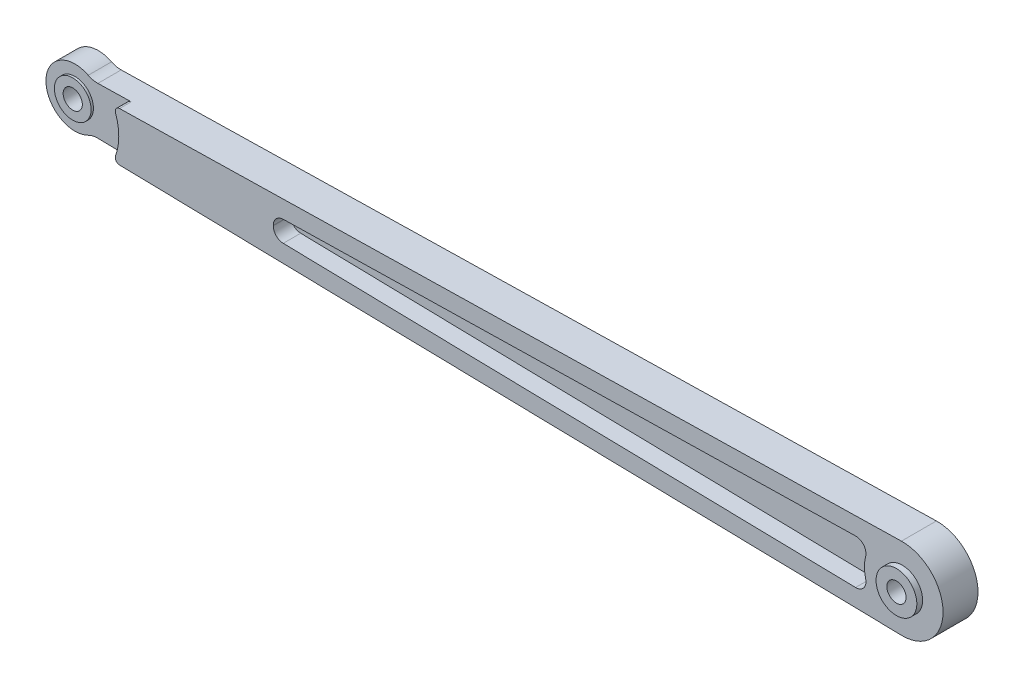
ISO-10303-21;
HEADER;
FILE_DESCRIPTION(('STEP AP214'),'2;1');
FILE_NAME('part.step','',(''),(''),'','','');
FILE_SCHEMA(('AUTOMOTIVE_DESIGN { 1 0 10303 214 1 1 1 1 }'));
ENDSEC;
DATA;
#1=APPLICATION_CONTEXT('core data for automotive mechanical design processes');
#2=APPLICATION_PROTOCOL_DEFINITION('international standard','automotive_design',2000,#1);
#3=PRODUCT_CONTEXT('',#1,'mechanical');
#4=PRODUCT('Part','Part','',(#3));
#5=PRODUCT_RELATED_PRODUCT_CATEGORY('part','',(#4));
#6=PRODUCT_DEFINITION_FORMATION('','',#4);
#7=PRODUCT_DEFINITION_CONTEXT('part definition',#1,'design');
#8=PRODUCT_DEFINITION('design','',#6,#7);
#9=PRODUCT_DEFINITION_SHAPE('','',#8);
#10=(LENGTH_UNIT() NAMED_UNIT(*) SI_UNIT(.MILLI.,.METRE.));
#11=(NAMED_UNIT(*) PLANE_ANGLE_UNIT() SI_UNIT($,.RADIAN.));
#12=(NAMED_UNIT(*) SI_UNIT($,.STERADIAN.) SOLID_ANGLE_UNIT());
#13=UNCERTAINTY_MEASURE_WITH_UNIT(LENGTH_MEASURE(1.E-05),#10,'distance_accuracy_value','');
#14=(GEOMETRIC_REPRESENTATION_CONTEXT(3) GLOBAL_UNCERTAINTY_ASSIGNED_CONTEXT((#13)) GLOBAL_UNIT_ASSIGNED_CONTEXT((#10,
#11,#12)) REPRESENTATION_CONTEXT('',''));
#15=CARTESIAN_POINT('',(0.,0.,0.));
#16=DIRECTION('',(0.,0.,1.));
#17=DIRECTION('',(1.,0.,0.));
#18=AXIS2_PLACEMENT_3D('',#15,#16,#17);
#19=CARTESIAN_POINT('',(0.,0.,6.));
#20=DIRECTION('',(0.,0.,1.));
#21=DIRECTION('',(1.,0.,0.));
#22=AXIS2_PLACEMENT_3D('',#19,#20,#21);
#23=PLANE('',#22);
#24=CARTESIAN_POINT('',(5.55111512312578E-13,-1.31893194282862E-12,6.));
#25=DIRECTION('',(0.,0.,1.));
#26=DIRECTION('',(1.,0.,0.));
#27=AXIS2_PLACEMENT_3D('',#24,#25,#26);
#28=CIRCLE('',#27,3.49999999999989);
#29=CARTESIAN_POINT('',(3.50000000000044,-1.31893194282862E-12,6.));
#30=VERTEX_POINT('',#29);
#31=EDGE_CURVE('E263',#30,#30,#28,.T.);
#32=ORIENTED_EDGE('',*,*,#31,.F.);
#33=EDGE_LOOP('',(#32));
#34=FACE_BOUND('',#33,.T.);
#35=DIRECTION('',(-0.999782962558486,-0.0208333333333333,0.));
#36=VECTOR('',#35,1.);
#37=CARTESIAN_POINT('',(-0.145833333333333,6.9984807379094,6.));
#38=LINE('',#37,#36);
#39=CARTESIAN_POINT('',(-0.145833333333333,6.9984807379094,6.));
#40=VERTEX_POINT('',#39);
#41=CARTESIAN_POINT('',(-134.364332130792,4.20165499705919,6.));
#42=VERTEX_POINT('',#41);
#43=EDGE_CURVE('E270',#40,#42,#38,.T.);
#44=ORIENTED_EDGE('',*,*,#43,.T.);
#45=CARTESIAN_POINT('',(-134.348707130792,3.45181777514032,6.));
#46=DIRECTION('',(0.,0.,1.));
#47=DIRECTION('',(1.,0.,0.));
#48=AXIS2_PLACEMENT_3D('',#45,#46,#47);
#49=CIRCLE('',#48,0.75);
#50=CARTESIAN_POINT('',(-135.054899291954,3.19924574281297,6.));
#51=VERTEX_POINT('',#50);
#52=EDGE_CURVE('E305',#42,#51,#49,.T.);
#53=ORIENTED_EDGE('',*,*,#52,.T.);
#54=CARTESIAN_POINT('',(-144.,0.,6.));
#55=DIRECTION('',(0.,0.,1.));
#56=DIRECTION('',(1.,0.,0.));
#57=AXIS2_PLACEMENT_3D('',#54,#55,#56);
#58=CIRCLE('',#57,9.50000000000001);
#59=CARTESIAN_POINT('',(-135.054899291954,-3.19924574281298,6.));
#60=VERTEX_POINT('',#59);
#61=EDGE_CURVE('E297',#60,#51,#58,.T.);
#62=ORIENTED_EDGE('',*,*,#61,.F.);
#63=CARTESIAN_POINT('',(-134.348707130792,-3.45181777514032,6.));
#64=DIRECTION('',(0.,0.,1.));
#65=DIRECTION('',(1.,0.,0.));
#66=AXIS2_PLACEMENT_3D('',#63,#64,#65);
#67=CIRCLE('',#66,0.75);
#68=CARTESIAN_POINT('',(-134.364332130792,-4.20165499705919,6.));
#69=VERTEX_POINT('',#68);
#70=EDGE_CURVE('E303',#60,#69,#67,.T.);
#71=ORIENTED_EDGE('',*,*,#70,.T.);
#72=DIRECTION('',(-0.999782962558486,0.0208333333333333,0.));
#73=VECTOR('',#72,1.);
#74=CARTESIAN_POINT('',(-0.145833333333333,-6.9984807379094,6.));
#75=LINE('',#74,#73);
#76=CARTESIAN_POINT('',(-0.145833333333333,-6.9984807379094,6.));
#77=VERTEX_POINT('',#76);
#78=EDGE_CURVE('E273',#77,#69,#75,.T.);
#79=ORIENTED_EDGE('',*,*,#78,.F.);
#80=CARTESIAN_POINT('',(0.,0.,6.));
#81=DIRECTION('',(0.,0.,1.));
#82=DIRECTION('',(1.,0.,0.));
#83=AXIS2_PLACEMENT_3D('',#80,#81,#82);
#84=CIRCLE('',#83,7.);
#85=EDGE_CURVE('E277',#77,#40,#84,.T.);
#86=ORIENTED_EDGE('',*,*,#85,.T.);
#87=EDGE_LOOP('',(#44,#53,#62,#71,#79,#86));
#88=FACE_BOUND('',#87,.T.);
#89=CARTESIAN_POINT('',(-106.225718101395,0.036972230579262,6.));
#90=DIRECTION('',(0.,0.,1.));
#91=DIRECTION('',(1.,0.,0.));
#92=AXIS2_PLACEMENT_3D('',#89,#90,#91);
#93=CIRCLE('',#92,1.75000000000001);
#94=CARTESIAN_POINT('',(-106.262176434729,1.78659241505661,6.));
#95=VERTEX_POINT('',#94);
#96=CARTESIAN_POINT('',(-107.975717263159,0.0352593886860282,6.));
#97=VERTEX_POINT('',#96);
#98=EDGE_CURVE('E57',#95,#97,#93,.T.);
#99=ORIENTED_EDGE('',*,*,#98,.F.);
#100=DIRECTION('',(-0.999782962558486,-0.0208333333333333,0.));
#101=VECTOR('',#100,1.);
#102=CARTESIAN_POINT('',(-8.01886458523978,3.83377239329242,6.));
#103=LINE('',#102,#101);
#104=CARTESIAN_POINT('',(-8.01886458523978,3.83377239329242,6.));
#105=VERTEX_POINT('',#104);
#106=EDGE_CURVE('E187',#105,#95,#103,.T.);
#107=ORIENTED_EDGE('',*,*,#106,.F.);
#108=CARTESIAN_POINT('',(-7.98240625190644,2.08415220881507,6.));
#109=DIRECTION('',(0.,0.,1.));
#110=DIRECTION('',(1.,0.,0.));
#111=AXIS2_PLACEMENT_3D('',#108,#109,#110);
#112=CIRCLE('',#111,1.75);
#113=CARTESIAN_POINT('',(-6.28916856210797,1.64205931603583,6.));
#114=VERTEX_POINT('',#113);
#115=EDGE_CURVE('E190',#114,#105,#112,.T.);
#116=ORIENTED_EDGE('',*,*,#115,.F.);
#117=CARTESIAN_POINT('',(5.55111512312578E-13,-1.31893194282862E-12,6.));
#118=DIRECTION('',(0.,0.,-1.));
#119=DIRECTION('',(-1.,0.,0.));
#120=AXIS2_PLACEMENT_3D('',#117,#118,#119);
#121=CIRCLE('',#120,6.49999999999989);
#122=CARTESIAN_POINT('',(-6.28916856210851,-1.64205931603638,6.));
#123=VERTEX_POINT('',#122);
#124=EDGE_CURVE('E218',#123,#114,#121,.T.);
#125=ORIENTED_EDGE('',*,*,#124,.F.);
#126=CARTESIAN_POINT('',(-7.98240625190714,-2.08415220881506,6.));
#127=DIRECTION('',(0.,0.,1.));
#128=DIRECTION('',(1.,0.,0.));
#129=AXIS2_PLACEMENT_3D('',#126,#127,#128);
#130=CIRCLE('',#129,1.75);
#131=CARTESIAN_POINT('',(-8.01886458524047,-3.83377239329241,6.));
#132=VERTEX_POINT('',#131);
#133=EDGE_CURVE('E215',#132,#123,#130,.T.);
#134=ORIENTED_EDGE('',*,*,#133,.F.);
#135=DIRECTION('',(0.999782962558485,-0.0208333333333333,0.));
#136=VECTOR('',#135,1.);
#137=CARTESIAN_POINT('',(-8.01886458524047,-3.83377239329241,6.));
#138=LINE('',#137,#136);
#139=CARTESIAN_POINT('',(-106.262176434729,-1.78659241505661,6.));
#140=VERTEX_POINT('',#139);
#141=EDGE_CURVE('E212',#140,#132,#138,.T.);
#142=ORIENTED_EDGE('',*,*,#141,.F.);
#143=CARTESIAN_POINT('',(-106.225718101395,-0.0369722305792641,6.));
#144=DIRECTION('',(0.,0.,1.));
#145=DIRECTION('',(1.,0.,0.));
#146=AXIS2_PLACEMENT_3D('',#143,#144,#145);
#147=CIRCLE('',#146,1.75000000000001);
#148=CARTESIAN_POINT('',(-107.975717263159,-0.0352593886860438,6.));
#149=VERTEX_POINT('',#148);
#150=EDGE_CURVE('E209',#149,#140,#147,.T.);
#151=ORIENTED_EDGE('',*,*,#150,.F.);
#152=CARTESIAN_POINT('',(-144.,0.,6.));
#153=DIRECTION('',(0.,0.,-1.));
#154=DIRECTION('',(1.,0.,0.));
#155=AXIS2_PLACEMENT_3D('',#152,#153,#154);
#156=CIRCLE('',#155,36.024299992205);
#157=EDGE_CURVE('E207',#97,#149,#156,.T.);
#158=ORIENTED_EDGE('',*,*,#157,.F.);
#159=EDGE_LOOP('',(#99,#107,#116,#125,#134,#142,#151,#158));
#160=FACE_BOUND('',#159,.T.);
#161=ADVANCED_FACE('F42',(#34,#88,#160),#23,.T.);
#162=CARTESIAN_POINT('',(-144.,0.,4.));
#163=DIRECTION('',(0.,0.,1.));
#164=DIRECTION('',(1.,0.,0.));
#165=AXIS2_PLACEMENT_3D('',#162,#163,#164);
#166=PLANE('',#165);
#167=DIRECTION('',(-0.999782962558486,-0.0208333333333333,0.));
#168=VECTOR('',#167,1.);
#169=CARTESIAN_POINT('',(-0.145833333333333,6.9984807379094,4.));
#170=LINE('',#169,#168);
#171=CARTESIAN_POINT('',(-134.364332130792,4.20165499705919,4.));
#172=VERTEX_POINT('',#171);
#173=CARTESIAN_POINT('',(-140.084201483099,4.08246518356727,4.));
#174=VERTEX_POINT('',#173);
#175=EDGE_CURVE('E254',#172,#174,#170,.T.);
#176=ORIENTED_EDGE('',*,*,#175,.T.);
#177=CARTESIAN_POINT('',(-140.157118149766,7.58170555252197,4.));
#178=DIRECTION('',(0.,0.,1.));
#179=DIRECTION('',(1.,0.,0.));
#180=AXIS2_PLACEMENT_3D('',#177,#178,#179);
#181=CIRCLE('',#180,3.5);
#182=CARTESIAN_POINT('',(-141.739481264568,4.45982679560115,4.));
#183=VERTEX_POINT('',#182);
#184=EDGE_CURVE('E332',#174,#183,#181,.F.);
#185=ORIENTED_EDGE('',*,*,#184,.T.);
#186=CARTESIAN_POINT('',(-144.,0.,4.));
#187=DIRECTION('',(0.,0.,1.));
#188=DIRECTION('',(1.,0.,0.));
#189=AXIS2_PLACEMENT_3D('',#186,#187,#188);
#190=CIRCLE('',#189,4.99999999999999);
#191=CARTESIAN_POINT('',(-141.739481264568,-4.45982679560115,4.));
#192=VERTEX_POINT('',#191);
#193=EDGE_CURVE('E251',#183,#192,#190,.T.);
#194=ORIENTED_EDGE('',*,*,#193,.T.);
#195=CARTESIAN_POINT('',(-140.157118149766,-7.58170555252197,4.));
#196=DIRECTION('',(0.,0.,1.));
#197=DIRECTION('',(1.,0.,0.));
#198=AXIS2_PLACEMENT_3D('',#195,#196,#197);
#199=CIRCLE('',#198,3.5);
#200=CARTESIAN_POINT('',(-140.084201483099,-4.08246518356727,4.));
#201=VERTEX_POINT('',#200);
#202=EDGE_CURVE('E12',#192,#201,#199,.F.);
#203=ORIENTED_EDGE('',*,*,#202,.T.);
#204=DIRECTION('',(-0.999782962558486,0.0208333333333333,0.));
#205=VECTOR('',#204,1.);
#206=CARTESIAN_POINT('',(-0.145833333333333,-6.9984807379094,4.));
#207=LINE('',#206,#205);
#208=CARTESIAN_POINT('',(-134.364332130792,-4.20165499705919,4.));
#209=VERTEX_POINT('',#208);
#210=EDGE_CURVE('E248',#209,#201,#207,.T.);
#211=ORIENTED_EDGE('',*,*,#210,.F.);
#212=CARTESIAN_POINT('',(-134.348707130792,-3.45181777514032,4.));
#213=DIRECTION('',(0.,0.,1.));
#214=DIRECTION('',(1.,0.,0.));
#215=AXIS2_PLACEMENT_3D('',#212,#213,#214);
#216=CIRCLE('',#215,0.75);
#217=CARTESIAN_POINT('',(-135.054899291954,-3.19924574281298,4.));
#218=VERTEX_POINT('',#217);
#219=EDGE_CURVE('E318',#209,#218,#216,.F.);
#220=ORIENTED_EDGE('',*,*,#219,.T.);
#221=CARTESIAN_POINT('',(-144.,0.,4.));
#222=DIRECTION('',(0.,0.,1.));
#223=DIRECTION('',(1.,0.,0.));
#224=AXIS2_PLACEMENT_3D('',#221,#222,#223);
#225=CIRCLE('',#224,9.50000000000001);
#226=CARTESIAN_POINT('',(-135.054899291954,3.19924574281297,4.));
#227=VERTEX_POINT('',#226);
#228=EDGE_CURVE('E243',#218,#227,#225,.T.);
#229=ORIENTED_EDGE('',*,*,#228,.T.);
#230=CARTESIAN_POINT('',(-134.348707130792,3.45181777514032,4.));
#231=DIRECTION('',(0.,0.,1.));
#232=DIRECTION('',(1.,0.,0.));
#233=AXIS2_PLACEMENT_3D('',#230,#231,#232);
#234=CIRCLE('',#233,0.75);
#235=EDGE_CURVE('E315',#227,#172,#234,.F.);
#236=ORIENTED_EDGE('',*,*,#235,.T.);
#237=EDGE_LOOP('',(#176,#185,#194,#203,#211,#220,#229,#236));
#238=FACE_BOUND('',#237,.T.);
#239=CARTESIAN_POINT('',(-144.,0.,4.));
#240=DIRECTION('',(0.,0.,1.));
#241=DIRECTION('',(1.,0.,0.));
#242=AXIS2_PLACEMENT_3D('',#239,#240,#241);
#243=CIRCLE('',#242,3.15000000000001);
#244=CARTESIAN_POINT('',(-140.85,0.,4.));
#245=VERTEX_POINT('',#244);
#246=EDGE_CURVE('E239',#245,#245,#243,.T.);
#247=ORIENTED_EDGE('',*,*,#246,.F.);
#248=EDGE_LOOP('',(#247));
#249=FACE_BOUND('',#248,.T.);
#250=ADVANCED_FACE('F346',(#238,#249),#166,.T.);
#251=CARTESIAN_POINT('',(-144.,0.,6.));
#252=DIRECTION('',(0.,0.,-1.));
#253=DIRECTION('',(-1.,0.,0.));
#254=AXIS2_PLACEMENT_3D('',#251,#252,#253);
#255=CYLINDRICAL_SURFACE('',#254,4.99999999999999);
#256=ORIENTED_EDGE('',*,*,#193,.F.);
#257=DIRECTION('',(0.,0.,-1.));
#258=VECTOR('',#257,1.);
#259=CARTESIAN_POINT('',(-141.739481264568,4.45982679560115,6.));
#260=LINE('',#259,#258);
#261=CARTESIAN_POINT('',(-141.739481264568,4.45982679560115,0.));
#262=VERTEX_POINT('',#261);
#263=EDGE_CURVE('E323',#183,#262,#260,.T.);
#264=ORIENTED_EDGE('',*,*,#263,.T.);
#265=CARTESIAN_POINT('',(-144.,0.,0.));
#266=DIRECTION('',(0.,0.,1.));
#267=DIRECTION('',(1.,0.,0.));
#268=AXIS2_PLACEMENT_3D('',#265,#266,#267);
#269=CIRCLE('',#268,4.99999999999999);
#270=CARTESIAN_POINT('',(-141.739481264568,-4.45982679560115,0.));
#271=VERTEX_POINT('',#270);
#272=EDGE_CURVE('E282',#262,#271,#269,.T.);
#273=ORIENTED_EDGE('',*,*,#272,.T.);
#274=DIRECTION('',(0.,0.,-1.));
#275=VECTOR('',#274,1.);
#276=CARTESIAN_POINT('',(-141.739481264568,-4.45982679560115,6.));
#277=LINE('',#276,#275);
#278=EDGE_CURVE('E321',#271,#192,#277,.F.);
#279=ORIENTED_EDGE('',*,*,#278,.T.);
#280=EDGE_LOOP('',(#256,#264,#273,#279));
#281=FACE_BOUND('',#280,.T.);
#282=ADVANCED_FACE('F342',(#281),#255,.T.);
#283=CARTESIAN_POINT('',(-144.,0.,6.));
#284=DIRECTION('',(0.,0.,-1.));
#285=DIRECTION('',(-1.,0.,0.));
#286=AXIS2_PLACEMENT_3D('',#283,#284,#285);
#287=CYLINDRICAL_SURFACE('',#286,1.65000000000002);
#288=CARTESIAN_POINT('',(-144.,0.,0.));
#289=DIRECTION('',(0.,0.,1.));
#290=DIRECTION('',(1.,0.,0.));
#291=AXIS2_PLACEMENT_3D('',#288,#289,#290);
#292=CIRCLE('',#291,1.65000000000002);
#293=CARTESIAN_POINT('',(-142.35,0.,0.));
#294=VERTEX_POINT('',#293);
#295=EDGE_CURVE('E274',#294,#294,#292,.T.);
#296=ORIENTED_EDGE('',*,*,#295,.F.);
#297=EDGE_LOOP('',(#296));
#298=FACE_BOUND('',#297,.T.);
#299=CARTESIAN_POINT('',(-144.,0.,4.4));
#300=DIRECTION('',(0.,0.,1.));
#301=DIRECTION('',(1.,0.,0.));
#302=AXIS2_PLACEMENT_3D('',#299,#300,#301);
#303=CIRCLE('',#302,1.65000000000002);
#304=CARTESIAN_POINT('',(-142.35,0.,4.4));
#305=VERTEX_POINT('',#304);
#306=EDGE_CURVE('E225',#305,#305,#303,.T.);
#307=ORIENTED_EDGE('',*,*,#306,.T.);
#308=EDGE_LOOP('',(#307));
#309=FACE_BOUND('',#308,.T.);
#310=ADVANCED_FACE('F450',(#298,#309),#287,.F.);
#311=CARTESIAN_POINT('',(-0.145833333333333,6.9984807379094,6.));
#312=DIRECTION('',(0.0208333333333333,-0.999782962558486,0.));
#313=DIRECTION('',(0.999782962558486,0.0208333333333333,0.));
#314=AXIS2_PLACEMENT_3D('',#311,#312,#313);
#315=PLANE('',#314);
#316=DIRECTION('',(-0.999782962558486,-0.0208333333333333,0.));
#317=VECTOR('',#316,1.);
#318=CARTESIAN_POINT('',(-0.145833333333333,6.9984807379094,0.));
#319=LINE('',#318,#317);
#320=CARTESIAN_POINT('',(-0.145833333333333,6.9984807379094,0.));
#321=VERTEX_POINT('',#320);
#322=CARTESIAN_POINT('',(-140.084201483099,4.08246518356727,0.));
#323=VERTEX_POINT('',#322);
#324=EDGE_CURVE('E267',#321,#323,#319,.T.);
#325=ORIENTED_EDGE('',*,*,#324,.T.);
#326=DIRECTION('',(0.,0.,1.));
#327=VECTOR('',#326,1.);
#328=CARTESIAN_POINT('',(-140.084201483099,4.08246518356727,4.));
#329=LINE('',#328,#327);
#330=EDGE_CURVE('E326',#323,#174,#329,.T.);
#331=ORIENTED_EDGE('',*,*,#330,.T.);
#332=ORIENTED_EDGE('',*,*,#175,.F.);
#333=DIRECTION('',(0.,0.,1.));
#334=VECTOR('',#333,1.);
#335=CARTESIAN_POINT('',(-134.364332130792,4.20165499705919,6.));
#336=LINE('',#335,#334);
#337=EDGE_CURVE('E300',#172,#42,#336,.T.);
#338=ORIENTED_EDGE('',*,*,#337,.T.);
#339=ORIENTED_EDGE('',*,*,#43,.F.);
#340=DIRECTION('',(0.,0.,-1.));
#341=VECTOR('',#340,1.);
#342=CARTESIAN_POINT('',(-0.145833333333333,6.9984807379094,6.));
#343=LINE('',#342,#341);
#344=EDGE_CURVE('E279',#40,#321,#343,.T.);
#345=ORIENTED_EDGE('',*,*,#344,.T.);
#346=EDGE_LOOP('',(#325,#331,#332,#338,#339,#345));
#347=FACE_BOUND('',#346,.T.);
#348=ADVANCED_FACE('F370',(#347),#315,.F.);
#349=CARTESIAN_POINT('',(-0.145833333333333,-6.9984807379094,6.));
#350=DIRECTION('',(-0.0208333333333333,-0.999782962558486,0.));
#351=DIRECTION('',(0.999782962558486,-0.0208333333333333,0.));
#352=AXIS2_PLACEMENT_3D('',#349,#350,#351);
#353=PLANE('',#352);
#354=ORIENTED_EDGE('',*,*,#210,.T.);
#355=DIRECTION('',(0.,0.,-1.));
#356=VECTOR('',#355,1.);
#357=CARTESIAN_POINT('',(-140.084201483099,-4.08246518356728,6.));
#358=LINE('',#357,#356);
#359=CARTESIAN_POINT('',(-140.084201483099,-4.08246518356728,0.));
#360=VERTEX_POINT('',#359);
#361=EDGE_CURVE('E328',#201,#360,#358,.T.);
#362=ORIENTED_EDGE('',*,*,#361,.T.);
#363=DIRECTION('',(-0.999782962558486,0.0208333333333333,0.));
#364=VECTOR('',#363,1.);
#365=CARTESIAN_POINT('',(-0.145833333333333,-6.9984807379094,0.));
#366=LINE('',#365,#364);
#367=CARTESIAN_POINT('',(-0.145833333333333,-6.9984807379094,0.));
#368=VERTEX_POINT('',#367);
#369=EDGE_CURVE('E284',#368,#360,#366,.T.);
#370=ORIENTED_EDGE('',*,*,#369,.F.);
#371=DIRECTION('',(0.,0.,-1.));
#372=VECTOR('',#371,1.);
#373=CARTESIAN_POINT('',(-0.145833333333333,-6.9984807379094,6.));
#374=LINE('',#373,#372);
#375=EDGE_CURVE('E295',#77,#368,#374,.T.);
#376=ORIENTED_EDGE('',*,*,#375,.F.);
#377=ORIENTED_EDGE('',*,*,#78,.T.);
#378=DIRECTION('',(0.,0.,-1.));
#379=VECTOR('',#378,1.);
#380=CARTESIAN_POINT('',(-134.364332130792,-4.20165499705919,4.));
#381=LINE('',#380,#379);
#382=EDGE_CURVE('E312',#69,#209,#381,.T.);
#383=ORIENTED_EDGE('',*,*,#382,.T.);
#384=EDGE_LOOP('',(#354,#362,#370,#376,#377,#383));
#385=FACE_BOUND('',#384,.T.);
#386=ADVANCED_FACE('F349',(#385),#353,.T.);
#387=CARTESIAN_POINT('',(0.,0.,6.));
#388=DIRECTION('',(0.,0.,-1.));
#389=DIRECTION('',(-1.,0.,0.));
#390=AXIS2_PLACEMENT_3D('',#387,#388,#389);
#391=CYLINDRICAL_SURFACE('',#390,7.);
#392=CARTESIAN_POINT('',(0.,0.,0.));
#393=DIRECTION('',(0.,0.,1.));
#394=DIRECTION('',(1.,0.,0.));
#395=AXIS2_PLACEMENT_3D('',#392,#393,#394);
#396=CIRCLE('',#395,7.);
#397=EDGE_CURVE('E289',#368,#321,#396,.T.);
#398=ORIENTED_EDGE('',*,*,#397,.T.);
#399=ORIENTED_EDGE('',*,*,#344,.F.);
#400=ORIENTED_EDGE('',*,*,#85,.F.);
#401=ORIENTED_EDGE('',*,*,#375,.T.);
#402=EDGE_LOOP('',(#398,#399,#400,#401));
#403=FACE_BOUND('',#402,.T.);
#404=ADVANCED_FACE('F375',(#403),#391,.T.);
#405=CARTESIAN_POINT('',(0.,0.,0.));
#406=DIRECTION('',(0.,0.,1.));
#407=DIRECTION('',(1.,0.,0.));
#408=AXIS2_PLACEMENT_3D('',#405,#406,#407);
#409=PLANE('',#408);
#410=CARTESIAN_POINT('',(5.55111512312578E-13,-1.31893194282862E-12,0.));
#411=DIRECTION('',(0.,0.,1.));
#412=DIRECTION('',(1.,0.,0.));
#413=AXIS2_PLACEMENT_3D('',#410,#411,#412);
#414=CIRCLE('',#413,1.64999999999989);
#415=CARTESIAN_POINT('',(1.65000000000044,-1.31893194282862E-12,0.));
#416=VERTEX_POINT('',#415);
#417=EDGE_CURVE('E260',#416,#416,#414,.T.);
#418=ORIENTED_EDGE('',*,*,#417,.T.);
#419=EDGE_LOOP('',(#418));
#420=FACE_BOUND('',#419,.T.);
#421=ORIENTED_EDGE('',*,*,#324,.F.);
#422=ORIENTED_EDGE('',*,*,#397,.F.);
#423=ORIENTED_EDGE('',*,*,#369,.T.);
#424=CARTESIAN_POINT('',(-140.157118149766,-7.58170555252197,0.));
#425=DIRECTION('',(0.,0.,1.));
#426=DIRECTION('',(1.,0.,0.));
#427=AXIS2_PLACEMENT_3D('',#424,#425,#426);
#428=CIRCLE('',#427,3.5);
#429=EDGE_CURVE('E50',#360,#271,#428,.T.);
#430=ORIENTED_EDGE('',*,*,#429,.T.);
#431=ORIENTED_EDGE('',*,*,#272,.F.);
#432=CARTESIAN_POINT('',(-140.157118149766,7.58170555252197,0.));
#433=DIRECTION('',(0.,0.,1.));
#434=DIRECTION('',(1.,0.,0.));
#435=AXIS2_PLACEMENT_3D('',#432,#433,#434);
#436=CIRCLE('',#435,3.5);
#437=EDGE_CURVE('E330',#262,#323,#436,.T.);
#438=ORIENTED_EDGE('',*,*,#437,.T.);
#439=EDGE_LOOP('',(#421,#422,#423,#430,#431,#438));
#440=FACE_BOUND('',#439,.T.);
#441=ORIENTED_EDGE('',*,*,#295,.T.);
#442=EDGE_LOOP('',(#441));
#443=FACE_BOUND('',#442,.T.);
#444=ADVANCED_FACE('F336',(#420,#440,#443),#409,.F.);
#445=CARTESIAN_POINT('',(5.55111512312578E-13,-1.31893194282862E-12,7.));
#446=DIRECTION('',(0.,0.,-1.));
#447=DIRECTION('',(-1.,0.,0.));
#448=AXIS2_PLACEMENT_3D('',#445,#446,#447);
#449=CYLINDRICAL_SURFACE('',#448,3.49999999999989);
#450=CARTESIAN_POINT('',(5.55111512312578E-13,-1.31893194282862E-12,7.));
#451=DIRECTION('',(0.,0.,1.));
#452=DIRECTION('',(1.,0.,0.));
#453=AXIS2_PLACEMENT_3D('',#450,#451,#452);
#454=CIRCLE('',#453,3.49999999999989);
#455=CARTESIAN_POINT('',(3.50000000000044,-1.31893194282862E-12,7.));
#456=VERTEX_POINT('',#455);
#457=EDGE_CURVE('E264',#456,#456,#454,.T.);
#458=ORIENTED_EDGE('',*,*,#457,.F.);
#459=EDGE_LOOP('',(#458));
#460=FACE_BOUND('',#459,.T.);
#461=ORIENTED_EDGE('',*,*,#31,.T.);
#462=EDGE_LOOP('',(#461));
#463=FACE_BOUND('',#462,.T.);
#464=ADVANCED_FACE('F442',(#460,#463),#449,.T.);
#465=CARTESIAN_POINT('',(5.55111512312578E-13,-1.31893194282862E-12,7.));
#466=DIRECTION('',(0.,0.,1.));
#467=DIRECTION('',(1.,0.,0.));
#468=AXIS2_PLACEMENT_3D('',#465,#466,#467);
#469=PLANE('',#468);
#470=CARTESIAN_POINT('',(5.55111512312578E-13,-1.31893194282862E-12,7.));
#471=DIRECTION('',(0.,0.,1.));
#472=DIRECTION('',(1.,0.,0.));
#473=AXIS2_PLACEMENT_3D('',#470,#471,#472);
#474=CIRCLE('',#473,1.64999999999989);
#475=CARTESIAN_POINT('',(1.65000000000044,-1.31893194282862E-12,7.));
#476=VERTEX_POINT('',#475);
#477=EDGE_CURVE('E257',#476,#476,#474,.T.);
#478=ORIENTED_EDGE('',*,*,#477,.F.);
#479=EDGE_LOOP('',(#478));
#480=FACE_BOUND('',#479,.T.);
#481=ORIENTED_EDGE('',*,*,#457,.T.);
#482=EDGE_LOOP('',(#481));
#483=FACE_BOUND('',#482,.T.);
#484=ADVANCED_FACE('F438',(#480,#483),#469,.T.);
#485=CARTESIAN_POINT('',(5.55111512312578E-13,-1.31893194282862E-12,-5.));
#486=DIRECTION('',(0.,0.,1.));
#487=DIRECTION('',(1.,0.,0.));
#488=AXIS2_PLACEMENT_3D('',#485,#486,#487);
#489=CYLINDRICAL_SURFACE('',#488,1.64999999999989);
#490=ORIENTED_EDGE('',*,*,#477,.T.);
#491=EDGE_LOOP('',(#490));
#492=FACE_BOUND('',#491,.T.);
#493=ORIENTED_EDGE('',*,*,#417,.F.);
#494=EDGE_LOOP('',(#493));
#495=FACE_BOUND('',#494,.T.);
#496=ADVANCED_FACE('F435',(#492,#495),#489,.F.);
#497=CARTESIAN_POINT('',(-144.,0.,4.));
#498=DIRECTION('',(0.,0.,1.));
#499=DIRECTION('',(1.,0.,0.));
#500=AXIS2_PLACEMENT_3D('',#497,#498,#499);
#501=CYLINDRICAL_SURFACE('',#500,9.50000000000001);
#502=ORIENTED_EDGE('',*,*,#61,.T.);
#503=DIRECTION('',(0.,0.,1.));
#504=VECTOR('',#503,1.);
#505=CARTESIAN_POINT('',(-135.054899291954,3.19924574281298,4.));
#506=LINE('',#505,#504);
#507=EDGE_CURVE('E310',#51,#227,#506,.F.);
#508=ORIENTED_EDGE('',*,*,#507,.T.);
#509=ORIENTED_EDGE('',*,*,#228,.F.);
#510=DIRECTION('',(0.,0.,1.));
#511=VECTOR('',#510,1.);
#512=CARTESIAN_POINT('',(-135.054899291954,-3.19924574281298,4.));
#513=LINE('',#512,#511);
#514=EDGE_CURVE('E307',#218,#60,#513,.T.);
#515=ORIENTED_EDGE('',*,*,#514,.T.);
#516=EDGE_LOOP('',(#502,#508,#509,#515));
#517=FACE_BOUND('',#516,.T.);
#518=ADVANCED_FACE('F359',(#517),#501,.F.);
#519=CARTESIAN_POINT('',(-134.348707130792,3.45181777514032,4.));
#520=DIRECTION('',(0.,0.,1.));
#521=DIRECTION('',(1.,0.,0.));
#522=AXIS2_PLACEMENT_3D('',#519,#520,#521);
#523=CYLINDRICAL_SURFACE('',#522,0.75);
#524=ORIENTED_EDGE('',*,*,#235,.F.);
#525=ORIENTED_EDGE('',*,*,#507,.F.);
#526=ORIENTED_EDGE('',*,*,#52,.F.);
#527=ORIENTED_EDGE('',*,*,#337,.F.);
#528=EDGE_LOOP('',(#524,#525,#526,#527));
#529=FACE_BOUND('',#528,.T.);
#530=ADVANCED_FACE('F363',(#529),#523,.T.);
#531=CARTESIAN_POINT('',(-134.348707130792,-3.45181777514032,4.));
#532=DIRECTION('',(0.,0.,1.));
#533=DIRECTION('',(1.,0.,0.));
#534=AXIS2_PLACEMENT_3D('',#531,#532,#533);
#535=CYLINDRICAL_SURFACE('',#534,0.75);
#536=ORIENTED_EDGE('',*,*,#219,.F.);
#537=ORIENTED_EDGE('',*,*,#382,.F.);
#538=ORIENTED_EDGE('',*,*,#70,.F.);
#539=ORIENTED_EDGE('',*,*,#514,.F.);
#540=EDGE_LOOP('',(#536,#537,#538,#539));
#541=FACE_BOUND('',#540,.T.);
#542=ADVANCED_FACE('F355',(#541),#535,.T.);
#543=CARTESIAN_POINT('',(-140.157118149766,7.58170555252197,6.));
#544=DIRECTION('',(0.,0.,-1.));
#545=DIRECTION('',(-1.,0.,0.));
#546=AXIS2_PLACEMENT_3D('',#543,#544,#545);
#547=CYLINDRICAL_SURFACE('',#546,3.5);
#548=ORIENTED_EDGE('',*,*,#184,.F.);
#549=ORIENTED_EDGE('',*,*,#330,.F.);
#550=ORIENTED_EDGE('',*,*,#437,.F.);
#551=ORIENTED_EDGE('',*,*,#263,.F.);
#552=EDGE_LOOP('',(#548,#549,#550,#551));
#553=FACE_BOUND('',#552,.T.);
#554=ADVANCED_FACE('F369',(#553),#547,.F.);
#555=CARTESIAN_POINT('',(-140.157118149766,-7.58170555252197,6.));
#556=DIRECTION('',(0.,0.,-1.));
#557=DIRECTION('',(-1.,0.,0.));
#558=AXIS2_PLACEMENT_3D('',#555,#556,#557);
#559=CYLINDRICAL_SURFACE('',#558,3.5);
#560=ORIENTED_EDGE('',*,*,#202,.F.);
#561=ORIENTED_EDGE('',*,*,#278,.F.);
#562=ORIENTED_EDGE('',*,*,#429,.F.);
#563=ORIENTED_EDGE('',*,*,#361,.F.);
#564=EDGE_LOOP('',(#560,#561,#562,#563));
#565=FACE_BOUND('',#564,.T.);
#566=ADVANCED_FACE('F44',(#565),#559,.F.);
#567=CARTESIAN_POINT('',(-144.,0.,4.4));
#568=DIRECTION('',(0.,0.,1.));
#569=DIRECTION('',(1.,0.,0.));
#570=AXIS2_PLACEMENT_3D('',#567,#568,#569);
#571=PLANE('',#570);
#572=CARTESIAN_POINT('',(-144.,0.,4.4));
#573=DIRECTION('',(0.,0.,1.));
#574=DIRECTION('',(1.,0.,0.));
#575=AXIS2_PLACEMENT_3D('',#572,#573,#574);
#576=CIRCLE('',#575,3.15000000000001);
#577=CARTESIAN_POINT('',(-140.85,0.,4.4));
#578=VERTEX_POINT('',#577);
#579=EDGE_CURVE('E240',#578,#578,#576,.T.);
#580=ORIENTED_EDGE('',*,*,#579,.T.);
#581=EDGE_LOOP('',(#580));
#582=FACE_BOUND('',#581,.T.);
#583=ORIENTED_EDGE('',*,*,#306,.F.);
#584=EDGE_LOOP('',(#583));
#585=FACE_BOUND('',#584,.T.);
#586=ADVANCED_FACE('F424',(#582,#585),#571,.T.);
#587=CARTESIAN_POINT('',(-144.,0.,4.4));
#588=DIRECTION('',(0.,0.,-1.));
#589=DIRECTION('',(-1.,0.,0.));
#590=AXIS2_PLACEMENT_3D('',#587,#588,#589);
#591=CYLINDRICAL_SURFACE('',#590,3.15000000000001);
#592=ORIENTED_EDGE('',*,*,#579,.F.);
#593=EDGE_LOOP('',(#592));
#594=FACE_BOUND('',#593,.T.);
#595=ORIENTED_EDGE('',*,*,#246,.T.);
#596=EDGE_LOOP('',(#595));
#597=FACE_BOUND('',#596,.T.);
#598=ADVANCED_FACE('F423',(#594,#597),#591,.T.);
#599=CARTESIAN_POINT('',(-106.225718101395,0.036972230579262,3.));
#600=DIRECTION('',(0.,0.,1.));
#601=DIRECTION('',(1.,0.,0.));
#602=AXIS2_PLACEMENT_3D('',#599,#600,#601);
#603=CYLINDRICAL_SURFACE('',#602,1.75000000000001);
#604=ORIENTED_EDGE('',*,*,#98,.T.);
#605=DIRECTION('',(0.,0.,1.));
#606=VECTOR('',#605,1.);
#607=CARTESIAN_POINT('',(-107.975717263159,0.0352593886860282,3.));
#608=LINE('',#607,#606);
#609=CARTESIAN_POINT('',(-107.975717263159,0.0352593886860282,3.));
#610=VERTEX_POINT('',#609);
#611=EDGE_CURVE('E164',#610,#97,#608,.T.);
#612=ORIENTED_EDGE('',*,*,#611,.F.);
#613=CARTESIAN_POINT('',(-106.225718101395,0.036972230579262,3.));
#614=DIRECTION('',(0.,0.,1.));
#615=DIRECTION('',(1.,0.,0.));
#616=AXIS2_PLACEMENT_3D('',#613,#614,#615);
#617=CIRCLE('',#616,1.75000000000001);
#618=CARTESIAN_POINT('',(-106.262176434729,1.78659241505661,3.));
#619=VERTEX_POINT('',#618);
#620=EDGE_CURVE('E168',#619,#610,#617,.T.);
#621=ORIENTED_EDGE('',*,*,#620,.F.);
#622=DIRECTION('',(0.,0.,1.));
#623=VECTOR('',#622,1.);
#624=CARTESIAN_POINT('',(-106.262176434729,1.78659241505661,3.));
#625=LINE('',#624,#623);
#626=EDGE_CURVE('E223',#619,#95,#625,.T.);
#627=ORIENTED_EDGE('',*,*,#626,.T.);
#628=EDGE_LOOP('',(#604,#612,#621,#627));
#629=FACE_BOUND('',#628,.T.);
#630=ADVANCED_FACE('F166',(#629),#603,.F.);
#631=CARTESIAN_POINT('',(-8.01886458523978,3.83377239329242,3.));
#632=DIRECTION('',(-0.0208333333333333,0.999782962558486,0.));
#633=DIRECTION('',(-0.999782962558486,-0.0208333333333333,0.));
#634=AXIS2_PLACEMENT_3D('',#631,#632,#633);
#635=PLANE('',#634);
#636=ORIENTED_EDGE('',*,*,#106,.T.);
#637=ORIENTED_EDGE('',*,*,#626,.F.);
#638=DIRECTION('',(-0.999782962558486,-0.0208333333333333,0.));
#639=VECTOR('',#638,1.);
#640=CARTESIAN_POINT('',(-8.01886458523978,3.83377239329242,3.));
#641=LINE('',#640,#639);
#642=CARTESIAN_POINT('',(-8.01886458523978,3.83377239329242,3.));
#643=VERTEX_POINT('',#642);
#644=EDGE_CURVE('E174',#643,#619,#641,.T.);
#645=ORIENTED_EDGE('',*,*,#644,.F.);
#646=DIRECTION('',(0.,0.,1.));
#647=VECTOR('',#646,1.);
#648=CARTESIAN_POINT('',(-8.01886458523978,3.83377239329242,3.));
#649=LINE('',#648,#647);
#650=EDGE_CURVE('E226',#643,#105,#649,.T.);
#651=ORIENTED_EDGE('',*,*,#650,.T.);
#652=EDGE_LOOP('',(#636,#637,#645,#651));
#653=FACE_BOUND('',#652,.T.);
#654=ADVANCED_FACE('F401',(#653),#635,.F.);
#655=CARTESIAN_POINT('',(-7.98240625190644,2.08415220881507,3.));
#656=DIRECTION('',(0.,0.,1.));
#657=DIRECTION('',(1.,0.,0.));
#658=AXIS2_PLACEMENT_3D('',#655,#656,#657);
#659=CYLINDRICAL_SURFACE('',#658,1.75);
#660=ORIENTED_EDGE('',*,*,#115,.T.);
#661=ORIENTED_EDGE('',*,*,#650,.F.);
#662=CARTESIAN_POINT('',(-7.98240625190644,2.08415220881507,3.));
#663=DIRECTION('',(0.,0.,1.));
#664=DIRECTION('',(1.,0.,0.));
#665=AXIS2_PLACEMENT_3D('',#662,#663,#664);
#666=CIRCLE('',#665,1.75);
#667=CARTESIAN_POINT('',(-6.28916856210797,1.64205931603583,3.));
#668=VERTEX_POINT('',#667);
#669=EDGE_CURVE('E203',#668,#643,#666,.T.);
#670=ORIENTED_EDGE('',*,*,#669,.F.);
#671=DIRECTION('',(0.,0.,1.));
#672=VECTOR('',#671,1.);
#673=CARTESIAN_POINT('',(-6.28916856210797,1.64205931603583,3.));
#674=LINE('',#673,#672);
#675=EDGE_CURVE('E228',#668,#114,#674,.T.);
#676=ORIENTED_EDGE('',*,*,#675,.T.);
#677=EDGE_LOOP('',(#660,#661,#670,#676));
#678=FACE_BOUND('',#677,.T.);
#679=ADVANCED_FACE('F402',(#678),#659,.F.);
#680=CARTESIAN_POINT('',(5.55111512312578E-13,-1.31893194282862E-12,3.));
#681=DIRECTION('',(0.,0.,1.));
#682=DIRECTION('',(1.,0.,0.));
#683=AXIS2_PLACEMENT_3D('',#680,#681,#682);
#684=CYLINDRICAL_SURFACE('',#683,6.49999999999989);
#685=ORIENTED_EDGE('',*,*,#124,.T.);
#686=ORIENTED_EDGE('',*,*,#675,.F.);
#687=CARTESIAN_POINT('',(5.55111512312578E-13,-1.31893194282862E-12,3.));
#688=DIRECTION('',(0.,0.,-1.));
#689=DIRECTION('',(-1.,0.,0.));
#690=AXIS2_PLACEMENT_3D('',#687,#688,#689);
#691=CIRCLE('',#690,6.49999999999989);
#692=CARTESIAN_POINT('',(-6.28916856210851,-1.64205931603638,3.));
#693=VERTEX_POINT('',#692);
#694=EDGE_CURVE('E200',#693,#668,#691,.T.);
#695=ORIENTED_EDGE('',*,*,#694,.F.);
#696=DIRECTION('',(0.,0.,1.));
#697=VECTOR('',#696,1.);
#698=CARTESIAN_POINT('',(-6.28916856210851,-1.64205931603638,3.));
#699=LINE('',#698,#697);
#700=EDGE_CURVE('E230',#693,#123,#699,.T.);
#701=ORIENTED_EDGE('',*,*,#700,.T.);
#702=EDGE_LOOP('',(#685,#686,#695,#701));
#703=FACE_BOUND('',#702,.T.);
#704=ADVANCED_FACE('F397',(#703),#684,.T.);
#705=CARTESIAN_POINT('',(-7.98240625190714,-2.08415220881506,3.));
#706=DIRECTION('',(0.,0.,1.));
#707=DIRECTION('',(1.,0.,0.));
#708=AXIS2_PLACEMENT_3D('',#705,#706,#707);
#709=CYLINDRICAL_SURFACE('',#708,1.75);
#710=ORIENTED_EDGE('',*,*,#133,.T.);
#711=ORIENTED_EDGE('',*,*,#700,.F.);
#712=CARTESIAN_POINT('',(-7.98240625190714,-2.08415220881506,3.));
#713=DIRECTION('',(0.,0.,1.));
#714=DIRECTION('',(1.,0.,0.));
#715=AXIS2_PLACEMENT_3D('',#712,#713,#714);
#716=CIRCLE('',#715,1.75);
#717=CARTESIAN_POINT('',(-8.01886458524047,-3.83377239329241,3.));
#718=VERTEX_POINT('',#717);
#719=EDGE_CURVE('E197',#718,#693,#716,.T.);
#720=ORIENTED_EDGE('',*,*,#719,.F.);
#721=DIRECTION('',(0.,0.,1.));
#722=VECTOR('',#721,1.);
#723=CARTESIAN_POINT('',(-8.01886458524047,-3.83377239329241,3.));
#724=LINE('',#723,#722);
#725=EDGE_CURVE('E232',#718,#132,#724,.T.);
#726=ORIENTED_EDGE('',*,*,#725,.T.);
#727=EDGE_LOOP('',(#710,#711,#720,#726));
#728=FACE_BOUND('',#727,.T.);
#729=ADVANCED_FACE('F393',(#728),#709,.F.);
#730=CARTESIAN_POINT('',(-8.01886458524047,-3.83377239329241,3.));
#731=DIRECTION('',(-0.0208333333333333,-0.999782962558486,0.));
#732=DIRECTION('',(0.999782962558486,-0.0208333333333333,0.));
#733=AXIS2_PLACEMENT_3D('',#730,#731,#732);
#734=PLANE('',#733);
#735=ORIENTED_EDGE('',*,*,#141,.T.);
#736=ORIENTED_EDGE('',*,*,#725,.F.);
#737=DIRECTION('',(0.999782962558485,-0.0208333333333333,0.));
#738=VECTOR('',#737,1.);
#739=CARTESIAN_POINT('',(-8.01886458524047,-3.83377239329241,3.));
#740=LINE('',#739,#738);
#741=CARTESIAN_POINT('',(-106.262176434729,-1.78659241505661,3.));
#742=VERTEX_POINT('',#741);
#743=EDGE_CURVE('E194',#742,#718,#740,.T.);
#744=ORIENTED_EDGE('',*,*,#743,.F.);
#745=DIRECTION('',(0.,0.,1.));
#746=VECTOR('',#745,1.);
#747=CARTESIAN_POINT('',(-106.262176434729,-1.78659241505661,3.));
#748=LINE('',#747,#746);
#749=EDGE_CURVE('E234',#742,#140,#748,.T.);
#750=ORIENTED_EDGE('',*,*,#749,.T.);
#751=EDGE_LOOP('',(#735,#736,#744,#750));
#752=FACE_BOUND('',#751,.T.);
#753=ADVANCED_FACE('F391',(#752),#734,.F.);
#754=CARTESIAN_POINT('',(-106.225718101395,-0.0369722305792641,3.));
#755=DIRECTION('',(0.,0.,1.));
#756=DIRECTION('',(1.,0.,0.));
#757=AXIS2_PLACEMENT_3D('',#754,#755,#756);
#758=CYLINDRICAL_SURFACE('',#757,1.75000000000001);
#759=ORIENTED_EDGE('',*,*,#150,.T.);
#760=ORIENTED_EDGE('',*,*,#749,.F.);
#761=CARTESIAN_POINT('',(-106.225718101395,-0.0369722305792641,3.));
#762=DIRECTION('',(0.,0.,1.));
#763=DIRECTION('',(1.,0.,0.));
#764=AXIS2_PLACEMENT_3D('',#761,#762,#763);
#765=CIRCLE('',#764,1.75000000000001);
#766=CARTESIAN_POINT('',(-107.975717263159,-0.0352593886860438,3.));
#767=VERTEX_POINT('',#766);
#768=EDGE_CURVE('E182',#767,#742,#765,.T.);
#769=ORIENTED_EDGE('',*,*,#768,.F.);
#770=DIRECTION('',(0.,0.,1.));
#771=VECTOR('',#770,1.);
#772=CARTESIAN_POINT('',(-107.975717263159,-0.0352593886860438,3.));
#773=LINE('',#772,#771);
#774=EDGE_CURVE('E173',#767,#149,#773,.T.);
#775=ORIENTED_EDGE('',*,*,#774,.T.);
#776=EDGE_LOOP('',(#759,#760,#769,#775));
#777=FACE_BOUND('',#776,.T.);
#778=ADVANCED_FACE('F387',(#777),#758,.F.);
#779=CARTESIAN_POINT('',(-144.,0.,3.));
#780=DIRECTION('',(0.,0.,1.));
#781=DIRECTION('',(1.,0.,0.));
#782=AXIS2_PLACEMENT_3D('',#779,#780,#781);
#783=CYLINDRICAL_SURFACE('',#782,36.024299992205);
#784=ORIENTED_EDGE('',*,*,#157,.T.);
#785=ORIENTED_EDGE('',*,*,#774,.F.);
#786=CARTESIAN_POINT('',(-144.,0.,3.));
#787=DIRECTION('',(0.,0.,-1.));
#788=DIRECTION('',(1.,0.,0.));
#789=AXIS2_PLACEMENT_3D('',#786,#787,#788);
#790=CIRCLE('',#789,36.024299992205);
#791=EDGE_CURVE('E177',#610,#767,#790,.T.);
#792=ORIENTED_EDGE('',*,*,#791,.F.);
#793=ORIENTED_EDGE('',*,*,#611,.T.);
#794=EDGE_LOOP('',(#784,#785,#792,#793));
#795=FACE_BOUND('',#794,.T.);
#796=ADVANCED_FACE('F178',(#795),#783,.T.);
#797=CARTESIAN_POINT('',(-106.225718101395,0.036972230579262,3.));
#798=DIRECTION('',(0.,0.,1.));
#799=DIRECTION('',(1.,0.,0.));
#800=AXIS2_PLACEMENT_3D('',#797,#798,#799);
#801=PLANE('',#800);
#802=ORIENTED_EDGE('',*,*,#620,.T.);
#803=ORIENTED_EDGE('',*,*,#791,.T.);
#804=ORIENTED_EDGE('',*,*,#768,.T.);
#805=ORIENTED_EDGE('',*,*,#743,.T.);
#806=ORIENTED_EDGE('',*,*,#719,.T.);
#807=ORIENTED_EDGE('',*,*,#694,.T.);
#808=ORIENTED_EDGE('',*,*,#669,.T.);
#809=ORIENTED_EDGE('',*,*,#644,.T.);
#810=EDGE_LOOP('',(#802,#803,#804,#805,#806,#807,#808,#809));
#811=FACE_BOUND('',#810,.T.);
#812=ADVANCED_FACE('F184',(#811),#801,.T.);
#813=CLOSED_SHELL('',(#161,#250,#282,#310,#348,#386,#404,#444,#464,#484,#496,#518,#530,#542,
#554,#566,#586,#598,#630,#654,#679,#704,#729,#753,#778,#796,#812));
#814=MANIFOLD_SOLID_BREP('B2',#813);
#815=ADVANCED_BREP_SHAPE_REPRESENTATION('',(#18,#814),#14);
#816=SHAPE_DEFINITION_REPRESENTATION(#9,#815);
ENDSEC;
END-ISO-10303-21;
